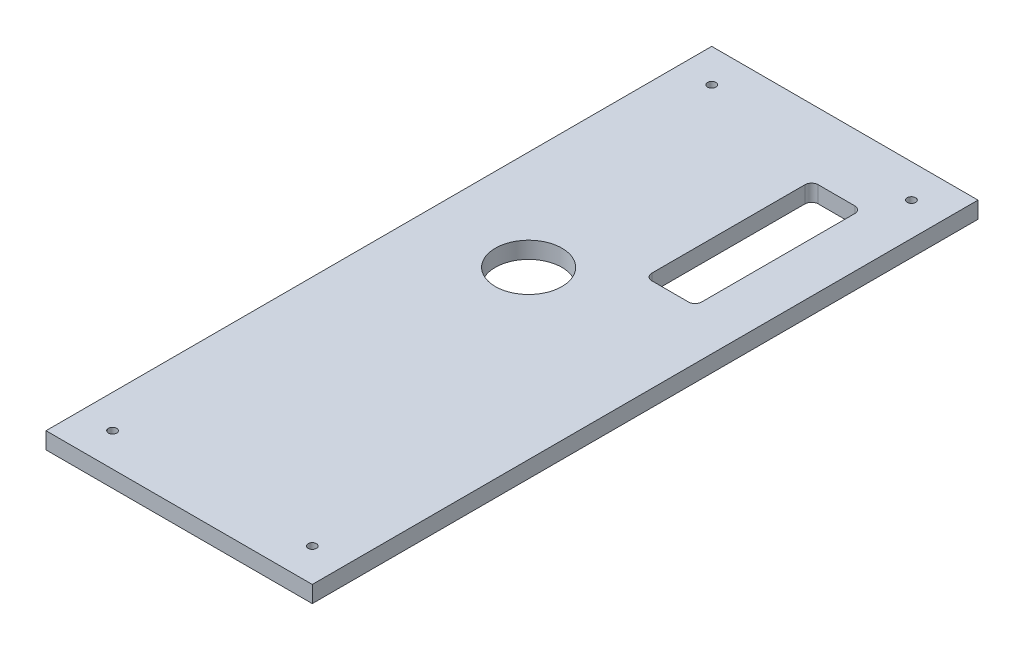
ISO-10303-21;
HEADER;
FILE_DESCRIPTION(('STEP AP214'),'2;1');
FILE_NAME('part.step','',(''),(''),'','','');
FILE_SCHEMA(('AUTOMOTIVE_DESIGN { 1 0 10303 214 1 1 1 1 }'));
ENDSEC;
DATA;
#1=APPLICATION_CONTEXT('core data for automotive mechanical design processes');
#2=APPLICATION_PROTOCOL_DEFINITION('international standard','automotive_design',2000,#1);
#3=PRODUCT_CONTEXT('',#1,'mechanical');
#4=PRODUCT('Part','Part','',(#3));
#5=PRODUCT_RELATED_PRODUCT_CATEGORY('part','',(#4));
#6=PRODUCT_DEFINITION_FORMATION('','',#4);
#7=PRODUCT_DEFINITION_CONTEXT('part definition',#1,'design');
#8=PRODUCT_DEFINITION('design','',#6,#7);
#9=PRODUCT_DEFINITION_SHAPE('','',#8);
#10=(LENGTH_UNIT() NAMED_UNIT(*) SI_UNIT(.MILLI.,.METRE.));
#11=(NAMED_UNIT(*) PLANE_ANGLE_UNIT() SI_UNIT($,.RADIAN.));
#12=(NAMED_UNIT(*) SI_UNIT($,.STERADIAN.) SOLID_ANGLE_UNIT());
#13=UNCERTAINTY_MEASURE_WITH_UNIT(LENGTH_MEASURE(1.E-05),#10,'distance_accuracy_value','');
#14=(GEOMETRIC_REPRESENTATION_CONTEXT(3) GLOBAL_UNCERTAINTY_ASSIGNED_CONTEXT((#13)) GLOBAL_UNIT_ASSIGNED_CONTEXT((#10,
#11,#12)) REPRESENTATION_CONTEXT('',''));
#15=CARTESIAN_POINT('',(0.,0.,0.));
#16=DIRECTION('',(0.,0.,1.));
#17=DIRECTION('',(1.,0.,0.));
#18=AXIS2_PLACEMENT_3D('',#15,#16,#17);
#19=CARTESIAN_POINT('',(0.,6.35,0.));
#20=DIRECTION('',(0.,1.,0.));
#21=DIRECTION('',(0.,0.,1.));
#22=AXIS2_PLACEMENT_3D('',#19,#20,#21);
#23=PLANE('',#22);
#24=CARTESIAN_POINT('',(38.1,6.35,-114.3));
#25=DIRECTION('',(0.,1.,0.));
#26=DIRECTION('',(0.,0.,1.));
#27=AXIS2_PLACEMENT_3D('',#24,#25,#26);
#28=CIRCLE('',#27,1.5875);
#29=CARTESIAN_POINT('',(38.1,6.35,-112.7125));
#30=VERTEX_POINT('',#29);
#31=EDGE_CURVE('E330',#30,#30,#28,.T.);
#32=ORIENTED_EDGE('',*,*,#31,.F.);
#33=EDGE_LOOP('',(#32));
#34=FACE_BOUND('',#33,.T.);
#35=CARTESIAN_POINT('',(-38.1,6.35,114.3));
#36=DIRECTION('',(0.,1.,0.));
#37=DIRECTION('',(0.,0.,1.));
#38=AXIS2_PLACEMENT_3D('',#35,#36,#37);
#39=CIRCLE('',#38,1.5875);
#40=CARTESIAN_POINT('',(-38.1,6.35,115.8875));
#41=VERTEX_POINT('',#40);
#42=EDGE_CURVE('E161',#41,#41,#39,.T.);
#43=ORIENTED_EDGE('',*,*,#42,.F.);
#44=EDGE_LOOP('',(#43));
#45=FACE_BOUND('',#44,.T.);
#46=DIRECTION('',(0.,0.,1.));
#47=VECTOR('',#46,1.);
#48=CARTESIAN_POINT('',(-50.8,6.35,127.));
#49=LINE('',#48,#47);
#50=CARTESIAN_POINT('',(-50.8,6.35,-127.));
#51=VERTEX_POINT('',#50);
#52=CARTESIAN_POINT('',(-50.8,6.35,127.));
#53=VERTEX_POINT('',#52);
#54=EDGE_CURVE('E197',#51,#53,#49,.T.);
#55=ORIENTED_EDGE('',*,*,#54,.T.);
#56=DIRECTION('',(1.,0.,0.));
#57=VECTOR('',#56,1.);
#58=CARTESIAN_POINT('',(50.8,6.35,127.));
#59=LINE('',#58,#57);
#60=CARTESIAN_POINT('',(50.8,6.35,127.));
#61=VERTEX_POINT('',#60);
#62=EDGE_CURVE('E200',#53,#61,#59,.T.);
#63=ORIENTED_EDGE('',*,*,#62,.T.);
#64=DIRECTION('',(0.,0.,-1.));
#65=VECTOR('',#64,1.);
#66=CARTESIAN_POINT('',(50.8,6.35,127.));
#67=LINE('',#66,#65);
#68=CARTESIAN_POINT('',(50.8,6.35,-127.));
#69=VERTEX_POINT('',#68);
#70=EDGE_CURVE('E203',#61,#69,#67,.T.);
#71=ORIENTED_EDGE('',*,*,#70,.T.);
#72=DIRECTION('',(-1.,0.,0.));
#73=VECTOR('',#72,1.);
#74=CARTESIAN_POINT('',(50.8,6.35,-127.));
#75=LINE('',#74,#73);
#76=EDGE_CURVE('E205',#69,#51,#75,.T.);
#77=ORIENTED_EDGE('',*,*,#76,.T.);
#78=EDGE_LOOP('',(#55,#63,#71,#77));
#79=FACE_BOUND('',#78,.T.);
#80=CARTESIAN_POINT('',(-12.7,6.35,-19.05));
#81=DIRECTION('',(0.,1.,0.));
#82=DIRECTION('',(0.,0.,1.));
#83=AXIS2_PLACEMENT_3D('',#80,#81,#82);
#84=CIRCLE('',#83,12.7);
#85=CARTESIAN_POINT('',(-12.7,6.35,-6.34999999999996));
#86=VERTEX_POINT('',#85);
#87=EDGE_CURVE('E191',#86,#86,#84,.T.);
#88=ORIENTED_EDGE('',*,*,#87,.F.);
#89=EDGE_LOOP('',(#88));
#90=FACE_BOUND('',#89,.T.);
#91=DIRECTION('',(1.,0.,0.));
#92=VECTOR('',#91,1.);
#93=CARTESIAN_POINT('',(29.21,6.35,-38.1));
#94=LINE('',#93,#92);
#95=CARTESIAN_POINT('',(15.24,6.35,-38.1));
#96=VERTEX_POINT('',#95);
#97=CARTESIAN_POINT('',(29.21,6.35,-38.1));
#98=VERTEX_POINT('',#97);
#99=EDGE_CURVE('E131',#96,#98,#94,.T.);
#100=ORIENTED_EDGE('',*,*,#99,.F.);
#101=CARTESIAN_POINT('',(15.24,6.35,-40.64));
#102=DIRECTION('',(0.,1.,0.));
#103=DIRECTION('',(0.,0.,-1.));
#104=AXIS2_PLACEMENT_3D('',#101,#102,#103);
#105=CIRCLE('',#104,2.54);
#106=CARTESIAN_POINT('',(12.7,6.35,-40.64));
#107=VERTEX_POINT('',#106);
#108=EDGE_CURVE('E123',#107,#96,#105,.T.);
#109=ORIENTED_EDGE('',*,*,#108,.F.);
#110=DIRECTION('',(0.,0.,1.));
#111=VECTOR('',#110,1.);
#112=CARTESIAN_POINT('',(12.7,6.35,-99.06));
#113=LINE('',#112,#111);
#114=CARTESIAN_POINT('',(12.7,6.35,-99.06));
#115=VERTEX_POINT('',#114);
#116=EDGE_CURVE('E158',#115,#107,#113,.T.);
#117=ORIENTED_EDGE('',*,*,#116,.F.);
#118=CARTESIAN_POINT('',(15.24,6.35,-99.06));
#119=DIRECTION('',(0.,1.,0.));
#120=DIRECTION('',(0.,0.,1.));
#121=AXIS2_PLACEMENT_3D('',#118,#119,#120);
#122=CIRCLE('',#121,2.54);
#123=CARTESIAN_POINT('',(15.24,6.35,-101.6));
#124=VERTEX_POINT('',#123);
#125=EDGE_CURVE('E156',#124,#115,#122,.T.);
#126=ORIENTED_EDGE('',*,*,#125,.F.);
#127=DIRECTION('',(-1.,0.,0.));
#128=VECTOR('',#127,1.);
#129=CARTESIAN_POINT('',(29.21,6.35,-101.6));
#130=LINE('',#129,#128);
#131=CARTESIAN_POINT('',(29.21,6.35,-101.6));
#132=VERTEX_POINT('',#131);
#133=EDGE_CURVE('E154',#132,#124,#130,.T.);
#134=ORIENTED_EDGE('',*,*,#133,.F.);
#135=CARTESIAN_POINT('',(29.21,6.35,-99.06));
#136=DIRECTION('',(0.,1.,0.));
#137=DIRECTION('',(0.,0.,-1.));
#138=AXIS2_PLACEMENT_3D('',#135,#136,#137);
#139=CIRCLE('',#138,2.54);
#140=CARTESIAN_POINT('',(31.75,6.35,-99.06));
#141=VERTEX_POINT('',#140);
#142=EDGE_CURVE('E152',#141,#132,#139,.T.);
#143=ORIENTED_EDGE('',*,*,#142,.F.);
#144=DIRECTION('',(0.,0.,-1.));
#145=VECTOR('',#144,1.);
#146=CARTESIAN_POINT('',(31.75,6.35,-99.06));
#147=LINE('',#146,#145);
#148=CARTESIAN_POINT('',(31.75,6.35,-40.64));
#149=VERTEX_POINT('',#148);
#150=EDGE_CURVE('E147',#149,#141,#147,.T.);
#151=ORIENTED_EDGE('',*,*,#150,.F.);
#152=CARTESIAN_POINT('',(29.21,6.35,-40.64));
#153=DIRECTION('',(0.,1.,0.));
#154=DIRECTION('',(0.,0.,-1.));
#155=AXIS2_PLACEMENT_3D('',#152,#153,#154);
#156=CIRCLE('',#155,2.54);
#157=EDGE_CURVE('E145',#98,#149,#156,.T.);
#158=ORIENTED_EDGE('',*,*,#157,.F.);
#159=EDGE_LOOP('',(#100,#109,#117,#126,#134,#143,#151,#158));
#160=FACE_BOUND('',#159,.T.);
#161=CARTESIAN_POINT('',(38.1,6.35,114.3));
#162=DIRECTION('',(0.,1.,0.));
#163=DIRECTION('',(0.,0.,1.));
#164=AXIS2_PLACEMENT_3D('',#161,#162,#163);
#165=CIRCLE('',#164,1.5875);
#166=CARTESIAN_POINT('',(38.1,6.35,115.8875));
#167=VERTEX_POINT('',#166);
#168=EDGE_CURVE('E336',#167,#167,#165,.T.);
#169=ORIENTED_EDGE('',*,*,#168,.F.);
#170=EDGE_LOOP('',(#169));
#171=FACE_BOUND('',#170,.T.);
#172=CARTESIAN_POINT('',(-38.1,6.35,-114.3));
#173=DIRECTION('',(0.,1.,0.));
#174=DIRECTION('',(0.,0.,1.));
#175=AXIS2_PLACEMENT_3D('',#172,#173,#174);
#176=CIRCLE('',#175,1.5875);
#177=CARTESIAN_POINT('',(-38.1,6.35,-112.7125));
#178=VERTEX_POINT('',#177);
#179=EDGE_CURVE('E321',#178,#178,#176,.T.);
#180=ORIENTED_EDGE('',*,*,#179,.F.);
#181=EDGE_LOOP('',(#180));
#182=FACE_BOUND('',#181,.T.);
#183=ADVANCED_FACE('F34',(#34,#45,#79,#90,#160,#171,#182),#23,.T.);
#184=CARTESIAN_POINT('',(0.,0.,0.));
#185=DIRECTION('',(0.,1.,0.));
#186=DIRECTION('',(0.,0.,1.));
#187=AXIS2_PLACEMENT_3D('',#184,#185,#186);
#188=PLANE('',#187);
#189=CARTESIAN_POINT('',(-12.7,0.,-19.05));
#190=DIRECTION('',(0.,1.,0.));
#191=DIRECTION('',(0.,0.,1.));
#192=AXIS2_PLACEMENT_3D('',#189,#190,#191);
#193=CIRCLE('',#192,12.7);
#194=CARTESIAN_POINT('',(-12.7,0.,-6.34999999999996));
#195=VERTEX_POINT('',#194);
#196=EDGE_CURVE('E139',#195,#195,#193,.T.);
#197=ORIENTED_EDGE('',*,*,#196,.T.);
#198=EDGE_LOOP('',(#197));
#199=FACE_BOUND('',#198,.T.);
#200=DIRECTION('',(0.,0.,1.));
#201=VECTOR('',#200,1.);
#202=CARTESIAN_POINT('',(-50.8,0.,127.));
#203=LINE('',#202,#201);
#204=CARTESIAN_POINT('',(-50.8,0.,-127.));
#205=VERTEX_POINT('',#204);
#206=CARTESIAN_POINT('',(-50.8,0.,127.));
#207=VERTEX_POINT('',#206);
#208=EDGE_CURVE('E194',#205,#207,#203,.T.);
#209=ORIENTED_EDGE('',*,*,#208,.F.);
#210=DIRECTION('',(-1.,0.,0.));
#211=VECTOR('',#210,1.);
#212=CARTESIAN_POINT('',(50.8,0.,-127.));
#213=LINE('',#212,#211);
#214=CARTESIAN_POINT('',(50.8,0.,-127.));
#215=VERTEX_POINT('',#214);
#216=EDGE_CURVE('E201',#215,#205,#213,.T.);
#217=ORIENTED_EDGE('',*,*,#216,.F.);
#218=DIRECTION('',(0.,0.,-1.));
#219=VECTOR('',#218,1.);
#220=CARTESIAN_POINT('',(50.8,0.,127.));
#221=LINE('',#220,#219);
#222=CARTESIAN_POINT('',(50.8,0.,127.));
#223=VERTEX_POINT('',#222);
#224=EDGE_CURVE('E212',#223,#215,#221,.T.);
#225=ORIENTED_EDGE('',*,*,#224,.F.);
#226=DIRECTION('',(1.,0.,0.));
#227=VECTOR('',#226,1.);
#228=CARTESIAN_POINT('',(50.8,0.,127.));
#229=LINE('',#228,#227);
#230=EDGE_CURVE('E210',#207,#223,#229,.T.);
#231=ORIENTED_EDGE('',*,*,#230,.F.);
#232=EDGE_LOOP('',(#209,#217,#225,#231));
#233=FACE_BOUND('',#232,.T.);
#234=CARTESIAN_POINT('',(15.24,0.,-40.64));
#235=DIRECTION('',(0.,1.,0.));
#236=DIRECTION('',(0.,0.,-1.));
#237=AXIS2_PLACEMENT_3D('',#234,#235,#236);
#238=CIRCLE('',#237,2.54);
#239=CARTESIAN_POINT('',(12.7,0.,-40.64));
#240=VERTEX_POINT('',#239);
#241=CARTESIAN_POINT('',(15.24,0.,-38.1));
#242=VERTEX_POINT('',#241);
#243=EDGE_CURVE('E57',#240,#242,#238,.T.);
#244=ORIENTED_EDGE('',*,*,#243,.T.);
#245=DIRECTION('',(1.,0.,0.));
#246=VECTOR('',#245,1.);
#247=CARTESIAN_POINT('',(29.21,0.,-38.1));
#248=LINE('',#247,#246);
#249=CARTESIAN_POINT('',(29.21,0.,-38.1));
#250=VERTEX_POINT('',#249);
#251=EDGE_CURVE('E138',#242,#250,#248,.T.);
#252=ORIENTED_EDGE('',*,*,#251,.T.);
#253=CARTESIAN_POINT('',(29.21,0.,-40.64));
#254=DIRECTION('',(0.,1.,0.));
#255=DIRECTION('',(0.,0.,-1.));
#256=AXIS2_PLACEMENT_3D('',#253,#254,#255);
#257=CIRCLE('',#256,2.54);
#258=CARTESIAN_POINT('',(31.75,0.,-40.64));
#259=VERTEX_POINT('',#258);
#260=EDGE_CURVE('E163',#250,#259,#257,.T.);
#261=ORIENTED_EDGE('',*,*,#260,.T.);
#262=DIRECTION('',(0.,0.,-1.));
#263=VECTOR('',#262,1.);
#264=CARTESIAN_POINT('',(31.75,0.,-99.06));
#265=LINE('',#264,#263);
#266=CARTESIAN_POINT('',(31.75,0.,-99.06));
#267=VERTEX_POINT('',#266);
#268=EDGE_CURVE('E166',#259,#267,#265,.T.);
#269=ORIENTED_EDGE('',*,*,#268,.T.);
#270=CARTESIAN_POINT('',(29.21,0.,-99.06));
#271=DIRECTION('',(0.,1.,0.));
#272=DIRECTION('',(0.,0.,-1.));
#273=AXIS2_PLACEMENT_3D('',#270,#271,#272);
#274=CIRCLE('',#273,2.54);
#275=CARTESIAN_POINT('',(29.21,0.,-101.6));
#276=VERTEX_POINT('',#275);
#277=EDGE_CURVE('E169',#267,#276,#274,.T.);
#278=ORIENTED_EDGE('',*,*,#277,.T.);
#279=DIRECTION('',(-1.,0.,0.));
#280=VECTOR('',#279,1.);
#281=CARTESIAN_POINT('',(29.21,0.,-101.6));
#282=LINE('',#281,#280);
#283=CARTESIAN_POINT('',(15.24,0.,-101.6));
#284=VERTEX_POINT('',#283);
#285=EDGE_CURVE('E172',#276,#284,#282,.T.);
#286=ORIENTED_EDGE('',*,*,#285,.T.);
#287=CARTESIAN_POINT('',(15.24,0.,-99.06));
#288=DIRECTION('',(0.,1.,0.));
#289=DIRECTION('',(0.,0.,1.));
#290=AXIS2_PLACEMENT_3D('',#287,#288,#289);
#291=CIRCLE('',#290,2.54);
#292=CARTESIAN_POINT('',(12.7,0.,-99.06));
#293=VERTEX_POINT('',#292);
#294=EDGE_CURVE('E175',#284,#293,#291,.T.);
#295=ORIENTED_EDGE('',*,*,#294,.T.);
#296=DIRECTION('',(0.,0.,1.));
#297=VECTOR('',#296,1.);
#298=CARTESIAN_POINT('',(12.7,0.,-99.06));
#299=LINE('',#298,#297);
#300=EDGE_CURVE('E132',#293,#240,#299,.T.);
#301=ORIENTED_EDGE('',*,*,#300,.T.);
#302=EDGE_LOOP('',(#244,#252,#261,#269,#278,#286,#295,#301));
#303=FACE_BOUND('',#302,.T.);
#304=CARTESIAN_POINT('',(-38.1,0.,114.3));
#305=DIRECTION('',(0.,1.,0.));
#306=DIRECTION('',(0.,0.,1.));
#307=AXIS2_PLACEMENT_3D('',#304,#305,#306);
#308=CIRCLE('',#307,1.5875);
#309=CARTESIAN_POINT('',(-38.1,0.,115.8875));
#310=VERTEX_POINT('',#309);
#311=EDGE_CURVE('E339',#310,#310,#308,.T.);
#312=ORIENTED_EDGE('',*,*,#311,.T.);
#313=EDGE_LOOP('',(#312));
#314=FACE_BOUND('',#313,.T.);
#315=CARTESIAN_POINT('',(38.1,0.,114.3));
#316=DIRECTION('',(0.,1.,0.));
#317=DIRECTION('',(0.,0.,1.));
#318=AXIS2_PLACEMENT_3D('',#315,#316,#317);
#319=CIRCLE('',#318,1.5875);
#320=CARTESIAN_POINT('',(38.1,0.,115.8875));
#321=VERTEX_POINT('',#320);
#322=EDGE_CURVE('E333',#321,#321,#319,.T.);
#323=ORIENTED_EDGE('',*,*,#322,.T.);
#324=EDGE_LOOP('',(#323));
#325=FACE_BOUND('',#324,.T.);
#326=CARTESIAN_POINT('',(38.1,0.,-114.3));
#327=DIRECTION('',(0.,1.,0.));
#328=DIRECTION('',(0.,0.,1.));
#329=AXIS2_PLACEMENT_3D('',#326,#327,#328);
#330=CIRCLE('',#329,1.5875);
#331=CARTESIAN_POINT('',(38.1,0.,-112.7125));
#332=VERTEX_POINT('',#331);
#333=EDGE_CURVE('E327',#332,#332,#330,.T.);
#334=ORIENTED_EDGE('',*,*,#333,.T.);
#335=EDGE_LOOP('',(#334));
#336=FACE_BOUND('',#335,.T.);
#337=CARTESIAN_POINT('',(-38.1,0.,-114.3));
#338=DIRECTION('',(0.,1.,0.));
#339=DIRECTION('',(0.,0.,1.));
#340=AXIS2_PLACEMENT_3D('',#337,#338,#339);
#341=CIRCLE('',#340,1.5875);
#342=CARTESIAN_POINT('',(-38.1,0.,-112.7125));
#343=VERTEX_POINT('',#342);
#344=EDGE_CURVE('E324',#343,#343,#341,.T.);
#345=ORIENTED_EDGE('',*,*,#344,.T.);
#346=EDGE_LOOP('',(#345));
#347=FACE_BOUND('',#346,.T.);
#348=ADVANCED_FACE('F230',(#199,#233,#303,#314,#325,#336,#347),#188,.F.);
#349=CARTESIAN_POINT('',(-50.8,6.35,127.));
#350=DIRECTION('',(1.,0.,0.));
#351=DIRECTION('',(0.,0.,-1.));
#352=AXIS2_PLACEMENT_3D('',#349,#350,#351);
#353=PLANE('',#352);
#354=ORIENTED_EDGE('',*,*,#208,.T.);
#355=DIRECTION('',(0.,-1.,0.));
#356=VECTOR('',#355,1.);
#357=CARTESIAN_POINT('',(-50.8,6.35,127.));
#358=LINE('',#357,#356);
#359=EDGE_CURVE('E11',#53,#207,#358,.T.);
#360=ORIENTED_EDGE('',*,*,#359,.F.);
#361=ORIENTED_EDGE('',*,*,#54,.F.);
#362=DIRECTION('',(0.,-1.,0.));
#363=VECTOR('',#362,1.);
#364=CARTESIAN_POINT('',(-50.8,6.35,-127.));
#365=LINE('',#364,#363);
#366=EDGE_CURVE('E207',#51,#205,#365,.T.);
#367=ORIENTED_EDGE('',*,*,#366,.T.);
#368=EDGE_LOOP('',(#354,#360,#361,#367));
#369=FACE_BOUND('',#368,.T.);
#370=ADVANCED_FACE('F36',(#369),#353,.F.);
#371=CARTESIAN_POINT('',(50.8,6.35,127.));
#372=DIRECTION('',(0.,0.,-1.));
#373=DIRECTION('',(-1.,0.,0.));
#374=AXIS2_PLACEMENT_3D('',#371,#372,#373);
#375=PLANE('',#374);
#376=ORIENTED_EDGE('',*,*,#230,.T.);
#377=DIRECTION('',(0.,-1.,0.));
#378=VECTOR('',#377,1.);
#379=CARTESIAN_POINT('',(50.8,6.35,127.));
#380=LINE('',#379,#378);
#381=EDGE_CURVE('E42',#61,#223,#380,.T.);
#382=ORIENTED_EDGE('',*,*,#381,.F.);
#383=ORIENTED_EDGE('',*,*,#62,.F.);
#384=ORIENTED_EDGE('',*,*,#359,.T.);
#385=EDGE_LOOP('',(#376,#382,#383,#384));
#386=FACE_BOUND('',#385,.T.);
#387=ADVANCED_FACE('F241',(#386),#375,.F.);
#388=CARTESIAN_POINT('',(50.8,6.35,127.));
#389=DIRECTION('',(-1.,0.,0.));
#390=DIRECTION('',(0.,0.,1.));
#391=AXIS2_PLACEMENT_3D('',#388,#389,#390);
#392=PLANE('',#391);
#393=ORIENTED_EDGE('',*,*,#224,.T.);
#394=DIRECTION('',(0.,-1.,0.));
#395=VECTOR('',#394,1.);
#396=CARTESIAN_POINT('',(50.8,6.35,-127.));
#397=LINE('',#396,#395);
#398=EDGE_CURVE('E217',#69,#215,#397,.T.);
#399=ORIENTED_EDGE('',*,*,#398,.F.);
#400=ORIENTED_EDGE('',*,*,#70,.F.);
#401=ORIENTED_EDGE('',*,*,#381,.T.);
#402=EDGE_LOOP('',(#393,#399,#400,#401));
#403=FACE_BOUND('',#402,.T.);
#404=ADVANCED_FACE('F224',(#403),#392,.F.);
#405=CARTESIAN_POINT('',(50.8,6.35,-127.));
#406=DIRECTION('',(0.,0.,1.));
#407=DIRECTION('',(1.,0.,0.));
#408=AXIS2_PLACEMENT_3D('',#405,#406,#407);
#409=PLANE('',#408);
#410=ORIENTED_EDGE('',*,*,#216,.T.);
#411=ORIENTED_EDGE('',*,*,#366,.F.);
#412=ORIENTED_EDGE('',*,*,#76,.F.);
#413=ORIENTED_EDGE('',*,*,#398,.T.);
#414=EDGE_LOOP('',(#410,#411,#412,#413));
#415=FACE_BOUND('',#414,.T.);
#416=ADVANCED_FACE('F234',(#415),#409,.F.);
#417=CARTESIAN_POINT('',(-12.7,6.35,-19.05));
#418=DIRECTION('',(0.,-1.,0.));
#419=DIRECTION('',(0.,0.,-1.));
#420=AXIS2_PLACEMENT_3D('',#417,#418,#419);
#421=CYLINDRICAL_SURFACE('',#420,12.7);
#422=ORIENTED_EDGE('',*,*,#87,.T.);
#423=EDGE_LOOP('',(#422));
#424=FACE_BOUND('',#423,.T.);
#425=ORIENTED_EDGE('',*,*,#196,.F.);
#426=EDGE_LOOP('',(#425));
#427=FACE_BOUND('',#426,.T.);
#428=ADVANCED_FACE('F259',(#424,#427),#421,.F.);
#429=CARTESIAN_POINT('',(15.24,6.35,-40.64));
#430=DIRECTION('',(0.,-1.,0.));
#431=DIRECTION('',(0.,0.,-1.));
#432=AXIS2_PLACEMENT_3D('',#429,#430,#431);
#433=CYLINDRICAL_SURFACE('',#432,2.54);
#434=ORIENTED_EDGE('',*,*,#243,.F.);
#435=DIRECTION('',(0.,-1.,0.));
#436=VECTOR('',#435,1.);
#437=CARTESIAN_POINT('',(12.7,6.35,-40.64));
#438=LINE('',#437,#436);
#439=EDGE_CURVE('E127',#107,#240,#438,.T.);
#440=ORIENTED_EDGE('',*,*,#439,.F.);
#441=ORIENTED_EDGE('',*,*,#108,.T.);
#442=DIRECTION('',(0.,-1.,0.));
#443=VECTOR('',#442,1.);
#444=CARTESIAN_POINT('',(15.24,6.35,-38.1));
#445=LINE('',#444,#443);
#446=EDGE_CURVE('E126',#96,#242,#445,.T.);
#447=ORIENTED_EDGE('',*,*,#446,.T.);
#448=EDGE_LOOP('',(#434,#440,#441,#447));
#449=FACE_BOUND('',#448,.T.);
#450=ADVANCED_FACE('F125',(#449),#433,.F.);
#451=CARTESIAN_POINT('',(29.21,6.35,-38.1));
#452=DIRECTION('',(0.,0.,-1.));
#453=DIRECTION('',(-1.,0.,0.));
#454=AXIS2_PLACEMENT_3D('',#451,#452,#453);
#455=PLANE('',#454);
#456=ORIENTED_EDGE('',*,*,#251,.F.);
#457=ORIENTED_EDGE('',*,*,#446,.F.);
#458=ORIENTED_EDGE('',*,*,#99,.T.);
#459=DIRECTION('',(0.,-1.,0.));
#460=VECTOR('',#459,1.);
#461=CARTESIAN_POINT('',(29.21,6.35,-38.1));
#462=LINE('',#461,#460);
#463=EDGE_CURVE('E140',#98,#250,#462,.T.);
#464=ORIENTED_EDGE('',*,*,#463,.T.);
#465=EDGE_LOOP('',(#456,#457,#458,#464));
#466=FACE_BOUND('',#465,.T.);
#467=ADVANCED_FACE('F135',(#466),#455,.T.);
#468=CARTESIAN_POINT('',(29.21,6.35,-40.64));
#469=DIRECTION('',(0.,-1.,0.));
#470=DIRECTION('',(0.,0.,-1.));
#471=AXIS2_PLACEMENT_3D('',#468,#469,#470);
#472=CYLINDRICAL_SURFACE('',#471,2.54);
#473=ORIENTED_EDGE('',*,*,#260,.F.);
#474=ORIENTED_EDGE('',*,*,#463,.F.);
#475=ORIENTED_EDGE('',*,*,#157,.T.);
#476=DIRECTION('',(0.,-1.,0.));
#477=VECTOR('',#476,1.);
#478=CARTESIAN_POINT('',(31.75,6.35,-40.64));
#479=LINE('',#478,#477);
#480=EDGE_CURVE('E188',#149,#259,#479,.T.);
#481=ORIENTED_EDGE('',*,*,#480,.T.);
#482=EDGE_LOOP('',(#473,#474,#475,#481));
#483=FACE_BOUND('',#482,.T.);
#484=ADVANCED_FACE('F276',(#483),#472,.F.);
#485=CARTESIAN_POINT('',(31.75,6.35,-99.06));
#486=DIRECTION('',(-1.,0.,0.));
#487=DIRECTION('',(0.,0.,1.));
#488=AXIS2_PLACEMENT_3D('',#485,#486,#487);
#489=PLANE('',#488);
#490=ORIENTED_EDGE('',*,*,#268,.F.);
#491=ORIENTED_EDGE('',*,*,#480,.F.);
#492=ORIENTED_EDGE('',*,*,#150,.T.);
#493=DIRECTION('',(0.,-1.,0.));
#494=VECTOR('',#493,1.);
#495=CARTESIAN_POINT('',(31.75,6.35,-99.06));
#496=LINE('',#495,#494);
#497=EDGE_CURVE('E186',#141,#267,#496,.T.);
#498=ORIENTED_EDGE('',*,*,#497,.T.);
#499=EDGE_LOOP('',(#490,#491,#492,#498));
#500=FACE_BOUND('',#499,.T.);
#501=ADVANCED_FACE('F281',(#500),#489,.T.);
#502=CARTESIAN_POINT('',(29.21,6.35,-99.06));
#503=DIRECTION('',(0.,-1.,0.));
#504=DIRECTION('',(0.,0.,-1.));
#505=AXIS2_PLACEMENT_3D('',#502,#503,#504);
#506=CYLINDRICAL_SURFACE('',#505,2.54);
#507=ORIENTED_EDGE('',*,*,#277,.F.);
#508=ORIENTED_EDGE('',*,*,#497,.F.);
#509=ORIENTED_EDGE('',*,*,#142,.T.);
#510=DIRECTION('',(0.,-1.,0.));
#511=VECTOR('',#510,1.);
#512=CARTESIAN_POINT('',(29.21,6.35,-101.6));
#513=LINE('',#512,#511);
#514=EDGE_CURVE('E184',#132,#276,#513,.T.);
#515=ORIENTED_EDGE('',*,*,#514,.T.);
#516=EDGE_LOOP('',(#507,#508,#509,#515));
#517=FACE_BOUND('',#516,.T.);
#518=ADVANCED_FACE('F285',(#517),#506,.F.);
#519=CARTESIAN_POINT('',(29.21,6.35,-101.6));
#520=DIRECTION('',(0.,0.,1.));
#521=DIRECTION('',(1.,0.,0.));
#522=AXIS2_PLACEMENT_3D('',#519,#520,#521);
#523=PLANE('',#522);
#524=ORIENTED_EDGE('',*,*,#285,.F.);
#525=ORIENTED_EDGE('',*,*,#514,.F.);
#526=ORIENTED_EDGE('',*,*,#133,.T.);
#527=DIRECTION('',(0.,-1.,0.));
#528=VECTOR('',#527,1.);
#529=CARTESIAN_POINT('',(15.24,6.35,-101.6));
#530=LINE('',#529,#528);
#531=EDGE_CURVE('E182',#124,#284,#530,.T.);
#532=ORIENTED_EDGE('',*,*,#531,.T.);
#533=EDGE_LOOP('',(#524,#525,#526,#532));
#534=FACE_BOUND('',#533,.T.);
#535=ADVANCED_FACE('F289',(#534),#523,.T.);
#536=CARTESIAN_POINT('',(15.24,6.35,-99.06));
#537=DIRECTION('',(0.,-1.,0.));
#538=DIRECTION('',(0.,0.,-1.));
#539=AXIS2_PLACEMENT_3D('',#536,#537,#538);
#540=CYLINDRICAL_SURFACE('',#539,2.54);
#541=ORIENTED_EDGE('',*,*,#294,.F.);
#542=ORIENTED_EDGE('',*,*,#531,.F.);
#543=ORIENTED_EDGE('',*,*,#125,.T.);
#544=DIRECTION('',(0.,-1.,0.));
#545=VECTOR('',#544,1.);
#546=CARTESIAN_POINT('',(12.7,6.35,-99.06));
#547=LINE('',#546,#545);
#548=EDGE_CURVE('E49',#115,#293,#547,.T.);
#549=ORIENTED_EDGE('',*,*,#548,.T.);
#550=EDGE_LOOP('',(#541,#542,#543,#549));
#551=FACE_BOUND('',#550,.T.);
#552=ADVANCED_FACE('F293',(#551),#540,.F.);
#553=CARTESIAN_POINT('',(12.7,6.35,-99.06));
#554=DIRECTION('',(1.,0.,0.));
#555=DIRECTION('',(0.,0.,-1.));
#556=AXIS2_PLACEMENT_3D('',#553,#554,#555);
#557=PLANE('',#556);
#558=ORIENTED_EDGE('',*,*,#300,.F.);
#559=ORIENTED_EDGE('',*,*,#548,.F.);
#560=ORIENTED_EDGE('',*,*,#116,.T.);
#561=ORIENTED_EDGE('',*,*,#439,.T.);
#562=EDGE_LOOP('',(#558,#559,#560,#561));
#563=FACE_BOUND('',#562,.T.);
#564=ADVANCED_FACE('F297',(#563),#557,.T.);
#565=CARTESIAN_POINT('',(-38.1,6.35,114.3));
#566=DIRECTION('',(0.,-1.,0.));
#567=DIRECTION('',(0.,0.,-1.));
#568=AXIS2_PLACEMENT_3D('',#565,#566,#567);
#569=CYLINDRICAL_SURFACE('',#568,1.5875);
#570=ORIENTED_EDGE('',*,*,#42,.T.);
#571=EDGE_LOOP('',(#570));
#572=FACE_BOUND('',#571,.T.);
#573=ORIENTED_EDGE('',*,*,#311,.F.);
#574=EDGE_LOOP('',(#573));
#575=FACE_BOUND('',#574,.T.);
#576=ADVANCED_FACE('F301',(#572,#575),#569,.F.);
#577=CARTESIAN_POINT('',(38.1,6.35,114.3));
#578=DIRECTION('',(0.,-1.,0.));
#579=DIRECTION('',(0.,0.,-1.));
#580=AXIS2_PLACEMENT_3D('',#577,#578,#579);
#581=CYLINDRICAL_SURFACE('',#580,1.5875);
#582=ORIENTED_EDGE('',*,*,#168,.T.);
#583=EDGE_LOOP('',(#582));
#584=FACE_BOUND('',#583,.T.);
#585=ORIENTED_EDGE('',*,*,#322,.F.);
#586=EDGE_LOOP('',(#585));
#587=FACE_BOUND('',#586,.T.);
#588=ADVANCED_FACE('F304',(#584,#587),#581,.F.);
#589=CARTESIAN_POINT('',(38.1,6.35,-114.3));
#590=DIRECTION('',(0.,-1.,0.));
#591=DIRECTION('',(0.,0.,-1.));
#592=AXIS2_PLACEMENT_3D('',#589,#590,#591);
#593=CYLINDRICAL_SURFACE('',#592,1.5875);
#594=ORIENTED_EDGE('',*,*,#31,.T.);
#595=EDGE_LOOP('',(#594));
#596=FACE_BOUND('',#595,.T.);
#597=ORIENTED_EDGE('',*,*,#333,.F.);
#598=EDGE_LOOP('',(#597));
#599=FACE_BOUND('',#598,.T.);
#600=ADVANCED_FACE('F308',(#596,#599),#593,.F.);
#601=CARTESIAN_POINT('',(-38.1,6.35,-114.3));
#602=DIRECTION('',(0.,-1.,0.));
#603=DIRECTION('',(0.,0.,-1.));
#604=AXIS2_PLACEMENT_3D('',#601,#602,#603);
#605=CYLINDRICAL_SURFACE('',#604,1.5875);
#606=ORIENTED_EDGE('',*,*,#179,.T.);
#607=EDGE_LOOP('',(#606));
#608=FACE_BOUND('',#607,.T.);
#609=ORIENTED_EDGE('',*,*,#344,.F.);
#610=EDGE_LOOP('',(#609));
#611=FACE_BOUND('',#610,.T.);
#612=ADVANCED_FACE('F312',(#608,#611),#605,.F.);
#613=CLOSED_SHELL('',(#183,#348,#370,#387,#404,#416,#428,#450,#467,#484,#501,#518,#535,#552,
#564,#576,#588,#600,#612));
#614=MANIFOLD_SOLID_BREP('B2',#613);
#615=ADVANCED_BREP_SHAPE_REPRESENTATION('',(#18,#614),#14);
#616=SHAPE_DEFINITION_REPRESENTATION(#9,#615);
ENDSEC;
END-ISO-10303-21;
